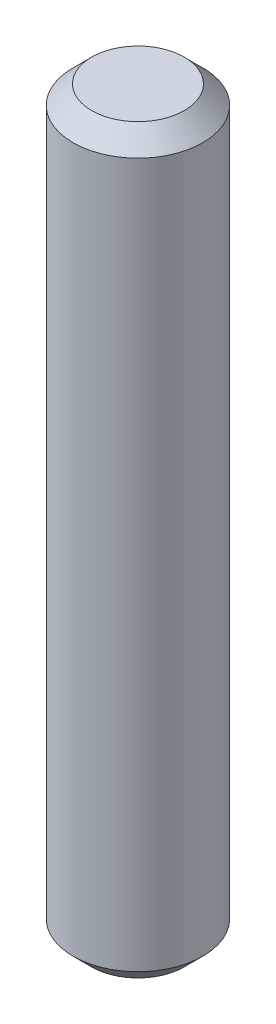
ISO-10303-21;
HEADER;
FILE_DESCRIPTION(('STEP AP214'),'2;1');
FILE_NAME('part.step','',(''),(''),'','','');
FILE_SCHEMA(('AUTOMOTIVE_DESIGN { 1 0 10303 214 1 1 1 1 }'));
ENDSEC;
DATA;
#1=APPLICATION_CONTEXT('core data for automotive mechanical design processes');
#2=APPLICATION_PROTOCOL_DEFINITION('international standard','automotive_design',2000,#1);
#3=PRODUCT_CONTEXT('',#1,'mechanical');
#4=PRODUCT('Part','Part','',(#3));
#5=PRODUCT_RELATED_PRODUCT_CATEGORY('part','',(#4));
#6=PRODUCT_DEFINITION_FORMATION('','',#4);
#7=PRODUCT_DEFINITION_CONTEXT('part definition',#1,'design');
#8=PRODUCT_DEFINITION('design','',#6,#7);
#9=PRODUCT_DEFINITION_SHAPE('','',#8);
#10=(LENGTH_UNIT() NAMED_UNIT(*) SI_UNIT(.MILLI.,.METRE.));
#11=(NAMED_UNIT(*) PLANE_ANGLE_UNIT() SI_UNIT($,.RADIAN.));
#12=(NAMED_UNIT(*) SI_UNIT($,.STERADIAN.) SOLID_ANGLE_UNIT());
#13=UNCERTAINTY_MEASURE_WITH_UNIT(LENGTH_MEASURE(1.E-05),#10,'distance_accuracy_value','');
#14=(GEOMETRIC_REPRESENTATION_CONTEXT(3) GLOBAL_UNCERTAINTY_ASSIGNED_CONTEXT((#13)) GLOBAL_UNIT_ASSIGNED_CONTEXT((#10,
#11,#12)) REPRESENTATION_CONTEXT('',''));
#15=CARTESIAN_POINT('',(0.,0.,0.));
#16=DIRECTION('',(0.,0.,1.));
#17=DIRECTION('',(1.,0.,0.));
#18=AXIS2_PLACEMENT_3D('',#15,#16,#17);
#19=CARTESIAN_POINT('',(0.,40.,0.));
#20=DIRECTION('',(0.,-1.,0.));
#21=DIRECTION('',(0.,0.,-1.));
#22=AXIS2_PLACEMENT_3D('',#19,#20,#21);
#23=CYLINDRICAL_SURFACE('',#22,3.5);
#24=CARTESIAN_POINT('',(0.,1.,0.));
#25=DIRECTION('',(0.,1.,0.));
#26=DIRECTION('',(0.,0.,1.));
#27=AXIS2_PLACEMENT_3D('',#24,#25,#26);
#28=CIRCLE('',#27,3.5);
#29=CARTESIAN_POINT('',(0.,1.,3.5));
#30=VERTEX_POINT('',#29);
#31=EDGE_CURVE('E50',#30,#30,#28,.T.);
#32=ORIENTED_EDGE('',*,*,#31,.T.);
#33=EDGE_LOOP('',(#32));
#34=FACE_BOUND('',#33,.T.);
#35=CARTESIAN_POINT('',(0.,39.,0.));
#36=DIRECTION('',(0.,1.,0.));
#37=DIRECTION('',(0.,0.,1.));
#38=AXIS2_PLACEMENT_3D('',#35,#36,#37);
#39=CIRCLE('',#38,3.5);
#40=CARTESIAN_POINT('',(0.,39.,3.5));
#41=VERTEX_POINT('',#40);
#42=EDGE_CURVE('E55',#41,#41,#39,.F.);
#43=ORIENTED_EDGE('',*,*,#42,.T.);
#44=EDGE_LOOP('',(#43));
#45=FACE_BOUND('',#44,.T.);
#46=ADVANCED_FACE('F37',(#34,#45),#23,.T.);
#47=CARTESIAN_POINT('',(0.,40.,0.));
#48=DIRECTION('',(0.,1.,0.));
#49=DIRECTION('',(0.,0.,1.));
#50=AXIS2_PLACEMENT_3D('',#47,#48,#49);
#51=PLANE('',#50);
#52=CARTESIAN_POINT('',(0.,40.,0.));
#53=DIRECTION('',(0.,1.,0.));
#54=DIRECTION('',(0.,0.,1.));
#55=AXIS2_PLACEMENT_3D('',#52,#53,#54);
#56=CIRCLE('',#55,2.50000000000001);
#57=CARTESIAN_POINT('',(0.,40.,2.50000000000001));
#58=VERTEX_POINT('',#57);
#59=EDGE_CURVE('E10',#58,#58,#56,.T.);
#60=ORIENTED_EDGE('',*,*,#59,.T.);
#61=EDGE_LOOP('',(#60));
#62=FACE_BOUND('',#61,.T.);
#63=ADVANCED_FACE('F72',(#62),#51,.T.);
#64=CARTESIAN_POINT('',(0.,0.,0.));
#65=DIRECTION('',(0.,1.,0.));
#66=DIRECTION('',(0.,0.,1.));
#67=AXIS2_PLACEMENT_3D('',#64,#65,#66);
#68=PLANE('',#67);
#69=CARTESIAN_POINT('',(0.,0.,0.));
#70=DIRECTION('',(0.,1.,0.));
#71=DIRECTION('',(0.,0.,1.));
#72=AXIS2_PLACEMENT_3D('',#69,#70,#71);
#73=CIRCLE('',#72,2.5);
#74=CARTESIAN_POINT('',(0.,0.,2.5));
#75=VERTEX_POINT('',#74);
#76=EDGE_CURVE('E45',#75,#75,#73,.F.);
#77=ORIENTED_EDGE('',*,*,#76,.T.);
#78=EDGE_LOOP('',(#77));
#79=FACE_BOUND('',#78,.T.);
#80=ADVANCED_FACE('F69',(#79),#68,.F.);
#81=CARTESIAN_POINT('',(0.,1.,0.));
#82=DIRECTION('',(0.,1.,0.));
#83=DIRECTION('',(0.,0.,1.));
#84=AXIS2_PLACEMENT_3D('',#81,#82,#83);
#85=CONICAL_SURFACE('',#84,3.5,0.78539816339745);
#86=ORIENTED_EDGE('',*,*,#76,.F.);
#87=EDGE_LOOP('',(#86));
#88=FACE_BOUND('',#87,.T.);
#89=ORIENTED_EDGE('',*,*,#31,.F.);
#90=EDGE_LOOP('',(#89));
#91=FACE_BOUND('',#90,.T.);
#92=ADVANCED_FACE('F65',(#88,#91),#85,.T.);
#93=CARTESIAN_POINT('',(0.,40.,0.));
#94=DIRECTION('',(0.,-1.,0.));
#95=DIRECTION('',(0.,0.,-1.));
#96=AXIS2_PLACEMENT_3D('',#93,#94,#95);
#97=CONICAL_SURFACE('',#96,2.50000000000001,0.785398163397447);
#98=ORIENTED_EDGE('',*,*,#42,.F.);
#99=EDGE_LOOP('',(#98));
#100=FACE_BOUND('',#99,.T.);
#101=ORIENTED_EDGE('',*,*,#59,.F.);
#102=EDGE_LOOP('',(#101));
#103=FACE_BOUND('',#102,.T.);
#104=ADVANCED_FACE('F39',(#100,#103),#97,.T.);
#105=CLOSED_SHELL('',(#46,#63,#80,#92,#104));
#106=MANIFOLD_SOLID_BREP('B2',#105);
#107=ADVANCED_BREP_SHAPE_REPRESENTATION('',(#18,#106),#14);
#108=SHAPE_DEFINITION_REPRESENTATION(#9,#107);
ENDSEC;
END-ISO-10303-21;
